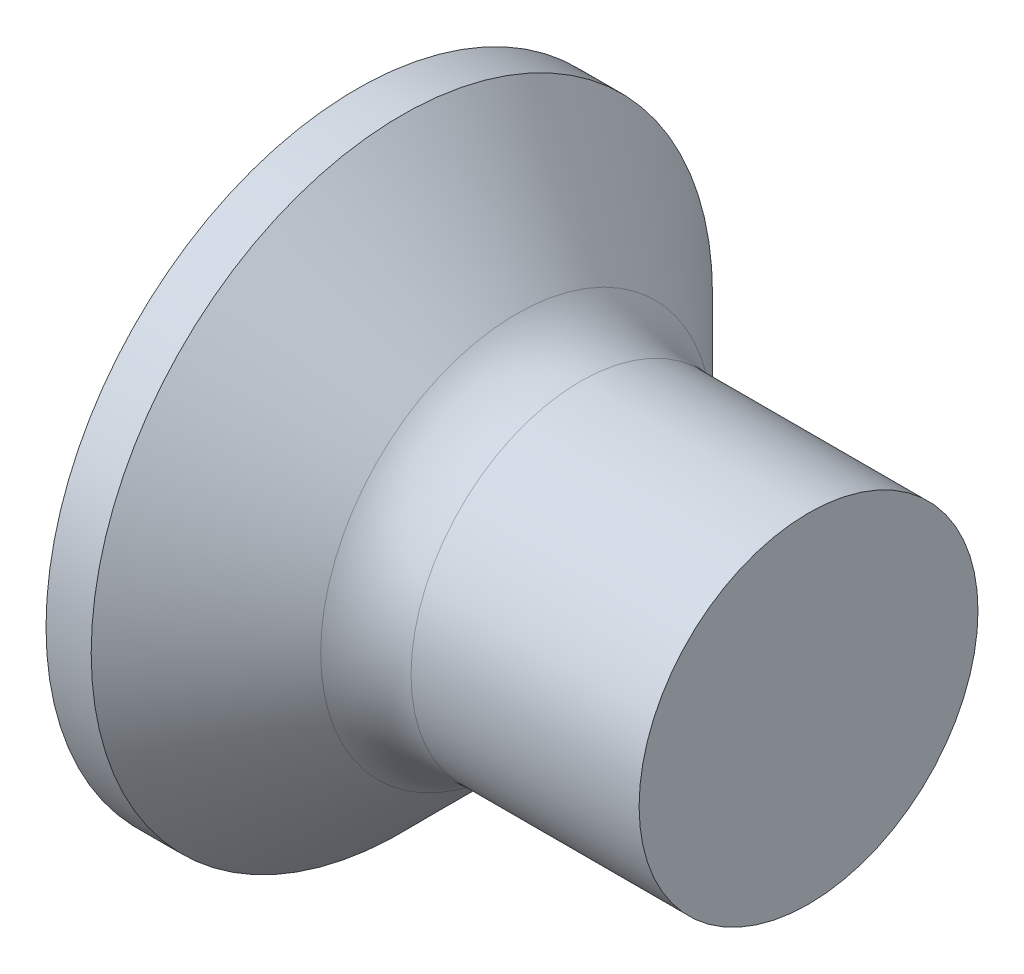
ISO-10303-21;
HEADER;
FILE_DESCRIPTION(('STEP AP214'),'2;1');
FILE_NAME('part.step','',(''),(''),'','','');
FILE_SCHEMA(('AUTOMOTIVE_DESIGN { 1 0 10303 214 1 1 1 1 }'));
ENDSEC;
DATA;
#1=APPLICATION_CONTEXT('core data for automotive mechanical design processes');
#2=APPLICATION_PROTOCOL_DEFINITION('international standard','automotive_design',2000,#1);
#3=PRODUCT_CONTEXT('',#1,'mechanical');
#4=PRODUCT('Part','Part','',(#3));
#5=PRODUCT_RELATED_PRODUCT_CATEGORY('part','',(#4));
#6=PRODUCT_DEFINITION_FORMATION('','',#4);
#7=PRODUCT_DEFINITION_CONTEXT('part definition',#1,'design');
#8=PRODUCT_DEFINITION('design','',#6,#7);
#9=PRODUCT_DEFINITION_SHAPE('','',#8);
#10=(LENGTH_UNIT() NAMED_UNIT(*) SI_UNIT(.MILLI.,.METRE.));
#11=(NAMED_UNIT(*) PLANE_ANGLE_UNIT() SI_UNIT($,.RADIAN.));
#12=(NAMED_UNIT(*) SI_UNIT($,.STERADIAN.) SOLID_ANGLE_UNIT());
#13=UNCERTAINTY_MEASURE_WITH_UNIT(LENGTH_MEASURE(1.E-05),#10,'distance_accuracy_value','');
#14=(GEOMETRIC_REPRESENTATION_CONTEXT(3) GLOBAL_UNCERTAINTY_ASSIGNED_CONTEXT((#13)) GLOBAL_UNIT_ASSIGNED_CONTEXT((#10,
#11,#12)) REPRESENTATION_CONTEXT('',''));
#15=CARTESIAN_POINT('',(0.,0.,0.));
#16=DIRECTION('',(0.,0.,1.));
#17=DIRECTION('',(1.,0.,0.));
#18=AXIS2_PLACEMENT_3D('',#15,#16,#17);
#19=CARTESIAN_POINT('',(2.01,-0.497851135403458,0.37));
#20=DIRECTION('',(0.,0.,-1.));
#21=DIRECTION('',(0.,1.,0.));
#22=AXIS2_PLACEMENT_3D('',#19,#20,#21);
#23=PLANE('',#22);
#24=DIRECTION('',(0.,-1.,0.));
#25=VECTOR('',#24,1.);
#26=CARTESIAN_POINT('',(0.,1.5,0.37));
#27=LINE('',#26,#25);
#28=CARTESIAN_POINT('',(0.,-0.590157547916263,0.37));
#29=VERTEX_POINT('',#28);
#30=CARTESIAN_POINT('',(0.,-1.5,0.37));
#31=VERTEX_POINT('',#30);
#32=EDGE_CURVE('E534',#29,#31,#27,.T.);
#33=ORIENTED_EDGE('',*,*,#32,.F.);
#34=CARTESIAN_POINT('',(-1.01053649691082,-0.672102030072118,0.37));
#35=CARTESIAN_POINT('',(-0.79970605871103,-0.655267098883947,0.37));
#36=CARTESIAN_POINT('',(-0.588886212503304,-0.638297110572311,0.37));
#37=CARTESIAN_POINT('',(-0.16727266252961,-0.603984130519828,0.37));
#38=CARTESIAN_POINT('',(0.0435210406290472,-0.586641131324258,0.37));
#39=CARTESIAN_POINT('',(0.465068838244709,-0.551479911667385,0.37));
#40=CARTESIAN_POINT('',(0.67582293271526,-0.533661691368909,0.37));
#41=CARTESIAN_POINT('',(1.09727362083221,-0.497387538872971,0.37));
#42=CARTESIAN_POINT('',(1.30797021521736,-0.478931615299089,0.37));
#43=CARTESIAN_POINT('',(1.67418894757201,-0.446067164121905,0.37));
#44=CARTESIAN_POINT('',(1.82972932585734,-0.431862501028414,0.37));
#45=CARTESIAN_POINT('',(2.14074770359484,-0.40279770973988,0.37));
#46=CARTESIAN_POINT('',(2.29622570356215,-0.38793758707517,0.37));
#47=CARTESIAN_POINT('',(2.60710169348415,-0.357305117937677,0.37));
#48=CARTESIAN_POINT('',(2.76249967840253,-0.34153271979064,0.37));
#49=CARTESIAN_POINT('',(2.99549070742189,-0.316847908281595,0.37));
#50=CARTESIAN_POINT('',(3.07313791118864,-0.308448465897182,0.37));
#51=CARTESIAN_POINT('',(3.22838341575769,-0.29120225104834,0.37));
#52=CARTESIAN_POINT('',(3.30598171599396,-0.282355473499083,0.37));
#53=CARTESIAN_POINT('',(3.38354828463398,-0.273232461289951,0.37));
#54=B_SPLINE_CURVE_WITH_KNOTS('',3,(#34,#35,#36,#37,#38,#39,#40,#41,#42,#43,#44,#45,#46,#47,#48,
#49,#50,#51,#52,#53),.UNSPECIFIED.,.F.,.F.,(4,2,2,2,2,2,2,2,2,4),(0.,0.634504777554397,
1.26902224766093,1.90353950036111,2.53804817592041,3.00661008438666,3.47516804019383,
3.94375256268972,4.17805198331267,4.41235406779909),.UNSPECIFIED.);
#55=CARTESIAN_POINT('',(2.01,-0.415013252800437,0.37));
#56=VERTEX_POINT('',#55);
#57=EDGE_CURVE('E223',#29,#56,#54,.T.);
#58=ORIENTED_EDGE('',*,*,#57,.T.);
#59=DIRECTION('',(0.,-1.,0.));
#60=VECTOR('',#59,1.);
#61=CARTESIAN_POINT('',(2.01,0.497851135403459,0.37));
#62=LINE('',#61,#60);
#63=CARTESIAN_POINT('',(2.01,-0.497851135403458,0.37));
#64=VERTEX_POINT('',#63);
#65=EDGE_CURVE('E429',#56,#64,#62,.T.);
#66=ORIENTED_EDGE('',*,*,#65,.T.);
#67=DIRECTION('',(0.894934391398442,0.446197753347436,0.));
#68=VECTOR('',#67,1.);
#69=CARTESIAN_POINT('',(0.,-1.5,0.37));
#70=LINE('',#69,#68);
#71=EDGE_CURVE('E543',#31,#64,#70,.T.);
#72=ORIENTED_EDGE('',*,*,#71,.F.);
#73=EDGE_LOOP('',(#33,#58,#66,#72));
#74=FACE_BOUND('',#73,.T.);
#75=ADVANCED_FACE('F43',(#74),#23,.T.);
#76=CARTESIAN_POINT('',(2.01,0.497851135403459,0.37));
#77=VERTEX_POINT('',#76);
#78=CARTESIAN_POINT('',(2.01,0.415013252800437,0.37));
#79=VERTEX_POINT('',#78);
#80=EDGE_CURVE('E425',#77,#79,#62,.T.);
#81=ORIENTED_EDGE('',*,*,#80,.T.);
#82=CARTESIAN_POINT('',(-1.01053649699026,0.672102030078459,0.37));
#83=CARTESIAN_POINT('',(-0.799706058781648,0.65526709888962,0.37));
#84=CARTESIAN_POINT('',(-0.588886212565099,0.638297110577309,0.37));
#85=CARTESIAN_POINT('',(-0.167272662573758,0.603984130523453,0.37));
#86=CARTESIAN_POINT('',(0.043521040593722,0.586641131327185,0.37));
#87=CARTESIAN_POINT('',(0.465068838236453,0.551479911668094,0.37));
#88=CARTESIAN_POINT('',(0.675822932725248,0.533661691368078,0.37));
#89=CARTESIAN_POINT('',(1.09727362087867,0.497387538868943,0.37));
#90=CARTESIAN_POINT('',(1.30797021528206,0.478931615293404,0.37));
#91=CARTESIAN_POINT('',(1.67418894765493,0.446067164114376,0.37));
#92=CARTESIAN_POINT('',(1.82972932594025,0.431862501020785,0.37));
#93=CARTESIAN_POINT('',(2.14074770367772,0.402797709732016,0.37));
#94=CARTESIAN_POINT('',(2.29622570364503,0.38793758706717,0.37));
#95=CARTESIAN_POINT('',(2.60710169356699,0.357305117929346,0.37));
#96=CARTESIAN_POINT('',(2.76249967848536,0.341532719782116,0.37));
#97=CARTESIAN_POINT('',(2.99549070750469,0.316847908272698,0.37));
#98=CARTESIAN_POINT('',(3.07313791127142,0.308448465888148,0.37));
#99=CARTESIAN_POINT('',(3.22838341584044,0.291202251038989,0.37));
#100=CARTESIAN_POINT('',(3.30598171607669,0.282355473489554,0.37));
#101=CARTESIAN_POINT('',(3.38354828471668,0.273232461280216,0.37));
#102=B_SPLINE_CURVE_WITH_KNOTS('',3,(#82,#83,#84,#85,#86,#87,#88,#89,#90,#91,#92,#93,#94,#95,
#96,#97,#98,#99,#100,#101),.UNSPECIFIED.,.F.,.F.,(4,2,2,2,2,2,2,2,2,4),(0.,0.634504777580945,
1.26902224771403,1.90353950046914,2.53804817608336,3.00661008454961,3.47516804035678,
3.94375256285269,4.17805198347564,4.41235406796206),.UNSPECIFIED.);
#103=CARTESIAN_POINT('',(0.,0.590157547916263,0.37));
#104=VERTEX_POINT('',#103);
#105=EDGE_CURVE('E216',#79,#104,#102,.F.);
#106=ORIENTED_EDGE('',*,*,#105,.T.);
#107=CARTESIAN_POINT('',(0.,1.5,0.37));
#108=VERTEX_POINT('',#107);
#109=EDGE_CURVE('E536',#108,#104,#27,.T.);
#110=ORIENTED_EDGE('',*,*,#109,.F.);
#111=DIRECTION('',(0.894934391398442,-0.446197753347436,0.));
#112=VECTOR('',#111,1.);
#113=CARTESIAN_POINT('',(0.,1.5,0.37));
#114=LINE('',#113,#112);
#115=EDGE_CURVE('E67',#108,#77,#114,.T.);
#116=ORIENTED_EDGE('',*,*,#115,.T.);
#117=EDGE_LOOP('',(#81,#106,#110,#116));
#118=FACE_BOUND('',#117,.T.);
#119=ADVANCED_FACE('F198',(#118),#23,.T.);
#120=CARTESIAN_POINT('',(2.01,0.497851135403458,-0.37));
#121=DIRECTION('',(0.,0.,1.));
#122=DIRECTION('',(1.,0.,0.));
#123=AXIS2_PLACEMENT_3D('',#120,#121,#122);
#124=PLANE('',#123);
#125=DIRECTION('',(0.,1.,0.));
#126=VECTOR('',#125,1.);
#127=CARTESIAN_POINT('',(2.01,-0.497851135403458,-0.37));
#128=LINE('',#127,#126);
#129=CARTESIAN_POINT('',(2.01,-0.497851135403458,-0.37));
#130=VERTEX_POINT('',#129);
#131=CARTESIAN_POINT('',(2.01,-0.415013252800437,-0.37));
#132=VERTEX_POINT('',#131);
#133=EDGE_CURVE('E440',#130,#132,#128,.T.);
#134=ORIENTED_EDGE('',*,*,#133,.T.);
#135=CARTESIAN_POINT('',(-1.01053649691082,-0.672102030072118,-0.37));
#136=CARTESIAN_POINT('',(-0.79970605871103,-0.655267098883947,-0.37));
#137=CARTESIAN_POINT('',(-0.588886212503305,-0.638297110572311,-0.37));
#138=CARTESIAN_POINT('',(-0.16727266252961,-0.603984130519828,-0.37));
#139=CARTESIAN_POINT('',(0.0435210406290472,-0.586641131324259,-0.37));
#140=CARTESIAN_POINT('',(0.465068838244709,-0.551479911667385,-0.37));
#141=CARTESIAN_POINT('',(0.67582293271526,-0.533661691368909,-0.37));
#142=CARTESIAN_POINT('',(1.09727362083221,-0.497387538872971,-0.37));
#143=CARTESIAN_POINT('',(1.30797021521736,-0.47893161529909,-0.37));
#144=CARTESIAN_POINT('',(1.67418894757201,-0.446067164121906,-0.37));
#145=CARTESIAN_POINT('',(1.82972932585734,-0.431862501028414,-0.37));
#146=CARTESIAN_POINT('',(2.14074770359484,-0.40279770973988,-0.37));
#147=CARTESIAN_POINT('',(2.29622570356215,-0.38793758707517,-0.37));
#148=CARTESIAN_POINT('',(2.60710169348415,-0.357305117937677,-0.37));
#149=CARTESIAN_POINT('',(2.76249967840254,-0.34153271979064,-0.37));
#150=CARTESIAN_POINT('',(2.99549070742189,-0.316847908281595,-0.37));
#151=CARTESIAN_POINT('',(3.07313791118864,-0.308448465897182,-0.37));
#152=CARTESIAN_POINT('',(3.22838341575769,-0.29120225104834,-0.37));
#153=CARTESIAN_POINT('',(3.30598171599396,-0.282355473499083,-0.37));
#154=CARTESIAN_POINT('',(3.38354828463398,-0.273232461289951,-0.37));
#155=B_SPLINE_CURVE_WITH_KNOTS('',3,(#135,#136,#137,#138,#139,#140,#141,#142,#143,#144,#145,
#146,#147,#148,#149,#150,#151,#152,#153,#154),.UNSPECIFIED.,.F.,.F.,(4,2,2,2,2,2,2,2,2,4),(0.,
0.634504777554397,1.26902224766093,1.90353950036111,2.53804817592041,3.00661008438666,
3.47516804019383,3.94375256268973,4.17805198331268,4.41235406779909),.UNSPECIFIED.);
#156=CARTESIAN_POINT('',(0.,-0.590157547916263,-0.37));
#157=VERTEX_POINT('',#156);
#158=EDGE_CURVE('E280',#132,#157,#155,.F.);
#159=ORIENTED_EDGE('',*,*,#158,.T.);
#160=DIRECTION('',(0.,1.,0.));
#161=VECTOR('',#160,1.);
#162=CARTESIAN_POINT('',(0.,-1.5,-0.37));
#163=LINE('',#162,#161);
#164=CARTESIAN_POINT('',(0.,-1.5,-0.37));
#165=VERTEX_POINT('',#164);
#166=EDGE_CURVE('E535',#165,#157,#163,.T.);
#167=ORIENTED_EDGE('',*,*,#166,.F.);
#168=DIRECTION('',(0.894934391398442,0.446197753347436,0.));
#169=VECTOR('',#168,1.);
#170=CARTESIAN_POINT('',(0.,-1.5,-0.37));
#171=LINE('',#170,#169);
#172=EDGE_CURVE('E546',#165,#130,#171,.T.);
#173=ORIENTED_EDGE('',*,*,#172,.T.);
#174=EDGE_LOOP('',(#134,#159,#167,#173));
#175=FACE_BOUND('',#174,.T.);
#176=ADVANCED_FACE('F204',(#175),#124,.T.);
#177=CARTESIAN_POINT('',(0.,0.590157547916263,-0.37));
#178=VERTEX_POINT('',#177);
#179=CARTESIAN_POINT('',(0.,1.5,-0.37));
#180=VERTEX_POINT('',#179);
#181=EDGE_CURVE('E542',#178,#180,#163,.T.);
#182=ORIENTED_EDGE('',*,*,#181,.F.);
#183=CARTESIAN_POINT('',(-1.01053649691082,0.672102030072118,-0.37));
#184=CARTESIAN_POINT('',(-0.79970605871103,0.655267098883947,-0.37));
#185=CARTESIAN_POINT('',(-0.588886212503304,0.638297110572311,-0.37));
#186=CARTESIAN_POINT('',(-0.16727266252961,0.603984130519828,-0.37));
#187=CARTESIAN_POINT('',(0.0435210406290473,0.586641131324259,-0.37));
#188=CARTESIAN_POINT('',(0.465068838244709,0.551479911667385,-0.37));
#189=CARTESIAN_POINT('',(0.67582293271526,0.533661691368909,-0.37));
#190=CARTESIAN_POINT('',(1.09727362083221,0.497387538872971,-0.37));
#191=CARTESIAN_POINT('',(1.30797021521736,0.478931615299089,-0.37));
#192=CARTESIAN_POINT('',(1.67418894757201,0.446067164121906,-0.37));
#193=CARTESIAN_POINT('',(1.82972932585734,0.431862501028415,-0.37));
#194=CARTESIAN_POINT('',(2.14074770359484,0.40279770973988,-0.37));
#195=CARTESIAN_POINT('',(2.29622570356215,0.38793758707517,-0.37));
#196=CARTESIAN_POINT('',(2.60710169348415,0.357305117937677,-0.37));
#197=CARTESIAN_POINT('',(2.76249967840253,0.34153271979064,-0.37));
#198=CARTESIAN_POINT('',(2.99549070742189,0.316847908281595,-0.37));
#199=CARTESIAN_POINT('',(3.07313791118864,0.308448465897183,-0.37));
#200=CARTESIAN_POINT('',(3.22838341575769,0.29120225104834,-0.37));
#201=CARTESIAN_POINT('',(3.30598171599396,0.282355473499083,-0.37));
#202=CARTESIAN_POINT('',(3.38354828463398,0.273232461289951,-0.37));
#203=B_SPLINE_CURVE_WITH_KNOTS('',3,(#183,#184,#185,#186,#187,#188,#189,#190,#191,#192,#193,
#194,#195,#196,#197,#198,#199,#200,#201,#202),.UNSPECIFIED.,.F.,.F.,(4,2,2,2,2,2,2,2,2,4),(0.,
0.634504777554397,1.26902224766093,1.90353950036111,2.53804817592041,3.00661008438666,
3.47516804019383,3.94375256268972,4.17805198331267,4.41235406779909),.UNSPECIFIED.);
#204=CARTESIAN_POINT('',(2.01,0.415013252800437,-0.37));
#205=VERTEX_POINT('',#204);
#206=EDGE_CURVE('E274',#178,#205,#203,.T.);
#207=ORIENTED_EDGE('',*,*,#206,.T.);
#208=CARTESIAN_POINT('',(2.01,0.497851135403459,-0.37));
#209=VERTEX_POINT('',#208);
#210=EDGE_CURVE('E442',#205,#209,#128,.T.);
#211=ORIENTED_EDGE('',*,*,#210,.T.);
#212=DIRECTION('',(0.894934391398442,-0.446197753347436,0.));
#213=VECTOR('',#212,1.);
#214=CARTESIAN_POINT('',(0.,1.5,-0.37));
#215=LINE('',#214,#213);
#216=EDGE_CURVE('E439',#180,#209,#215,.T.);
#217=ORIENTED_EDGE('',*,*,#216,.F.);
#218=EDGE_LOOP('',(#182,#207,#211,#217));
#219=FACE_BOUND('',#218,.T.);
#220=ADVANCED_FACE('F554',(#219),#124,.T.);
#221=CARTESIAN_POINT('',(2.01,0.497851135403459,-0.37));
#222=DIRECTION('',(1.,0.,0.));
#223=DIRECTION('',(0.,0.,-1.));
#224=AXIS2_PLACEMENT_3D('',#221,#222,#223);
#225=PLANE('',#224);
#226=CARTESIAN_POINT('',(2.01,0.,0.));
#227=DIRECTION('',(-1.,0.,0.));
#228=DIRECTION('',(0.,0.,1.));
#229=AXIS2_PLACEMENT_3D('',#226,#227,#228);
#230=CIRCLE('',#229,0.555999999999999);
#231=CARTESIAN_POINT('',(2.01,-0.24754847399547,-0.497851135403459));
#232=VERTEX_POINT('',#231);
#233=CARTESIAN_POINT('',(2.01,-0.369999999999999,-0.415013252800438));
#234=VERTEX_POINT('',#233);
#235=EDGE_CURVE('E394',#232,#234,#230,.T.);
#236=ORIENTED_EDGE('',*,*,#235,.F.);
#237=DIRECTION('',(0.,1.,0.));
#238=VECTOR('',#237,1.);
#239=CARTESIAN_POINT('',(2.01,-0.369999999999998,-0.49785113540346));
#240=LINE('',#239,#238);
#241=CARTESIAN_POINT('',(2.01,-0.369999999999998,-0.49785113540346));
#242=VERTEX_POINT('',#241);
#243=EDGE_CURVE('E516',#242,#232,#240,.T.);
#244=ORIENTED_EDGE('',*,*,#243,.F.);
#245=DIRECTION('',(0.,0.,-1.));
#246=VECTOR('',#245,1.);
#247=CARTESIAN_POINT('',(2.01,-0.370000000000002,0.497851135403457));
#248=LINE('',#247,#246);
#249=EDGE_CURVE('E520',#234,#242,#248,.T.);
#250=ORIENTED_EDGE('',*,*,#249,.F.);
#251=EDGE_LOOP('',(#236,#244,#250));
#252=FACE_BOUND('',#251,.T.);
#253=ADVANCED_FACE('F568',(#252),#225,.F.);
#254=CARTESIAN_POINT('',(2.01,-0.497851135403458,-0.247548473995472));
#255=VERTEX_POINT('',#254);
#256=EDGE_CURVE('E386',#132,#255,#230,.T.);
#257=ORIENTED_EDGE('',*,*,#256,.F.);
#258=ORIENTED_EDGE('',*,*,#133,.F.);
#259=DIRECTION('',(0.,0.,-1.));
#260=VECTOR('',#259,1.);
#261=CARTESIAN_POINT('',(2.01,-0.497851135403458,0.37));
#262=LINE('',#261,#260);
#263=EDGE_CURVE('E428',#255,#130,#262,.T.);
#264=ORIENTED_EDGE('',*,*,#263,.F.);
#265=EDGE_LOOP('',(#257,#258,#264));
#266=FACE_BOUND('',#265,.T.);
#267=ADVANCED_FACE('F574',(#266),#225,.F.);
#268=CARTESIAN_POINT('',(2.01,-0.497851135403458,0.247548473995472));
#269=VERTEX_POINT('',#268);
#270=EDGE_CURVE('E379',#269,#56,#230,.T.);
#271=ORIENTED_EDGE('',*,*,#270,.F.);
#272=EDGE_CURVE('E432',#64,#269,#262,.T.);
#273=ORIENTED_EDGE('',*,*,#272,.F.);
#274=ORIENTED_EDGE('',*,*,#65,.F.);
#275=EDGE_LOOP('',(#271,#273,#274));
#276=FACE_BOUND('',#275,.T.);
#277=ADVANCED_FACE('F580',(#276),#225,.F.);
#278=CARTESIAN_POINT('',(2.01,-0.370000000000001,0.415013252800436));
#279=VERTEX_POINT('',#278);
#280=CARTESIAN_POINT('',(2.01,-0.247548473995473,0.497851135403458));
#281=VERTEX_POINT('',#280);
#282=EDGE_CURVE('E59',#279,#281,#230,.T.);
#283=ORIENTED_EDGE('',*,*,#282,.F.);
#284=CARTESIAN_POINT('',(2.01,-0.370000000000002,0.497851135403457));
#285=VERTEX_POINT('',#284);
#286=EDGE_CURVE('E522',#285,#279,#248,.T.);
#287=ORIENTED_EDGE('',*,*,#286,.F.);
#288=DIRECTION('',(0.,-1.,0.));
#289=VECTOR('',#288,1.);
#290=CARTESIAN_POINT('',(2.01,0.369999999999998,0.49785113540346));
#291=LINE('',#290,#289);
#292=EDGE_CURVE('E521',#281,#285,#291,.T.);
#293=ORIENTED_EDGE('',*,*,#292,.F.);
#294=EDGE_LOOP('',(#283,#287,#293));
#295=FACE_BOUND('',#294,.T.);
#296=ADVANCED_FACE('F607',(#295),#225,.F.);
#297=CARTESIAN_POINT('',(2.01,0.24754847399547,0.497851135403459));
#298=VERTEX_POINT('',#297);
#299=CARTESIAN_POINT('',(2.01,0.369999999999999,0.415013252800438));
#300=VERTEX_POINT('',#299);
#301=EDGE_CURVE('E361',#298,#300,#230,.T.);
#302=ORIENTED_EDGE('',*,*,#301,.F.);
#303=CARTESIAN_POINT('',(2.01,0.369999999999998,0.49785113540346));
#304=VERTEX_POINT('',#303);
#305=EDGE_CURVE('E517',#304,#298,#291,.T.);
#306=ORIENTED_EDGE('',*,*,#305,.F.);
#307=DIRECTION('',(0.,0.,1.));
#308=VECTOR('',#307,1.);
#309=CARTESIAN_POINT('',(2.01,0.370000000000002,-0.497851135403457));
#310=LINE('',#309,#308);
#311=EDGE_CURVE('E231',#300,#304,#310,.T.);
#312=ORIENTED_EDGE('',*,*,#311,.F.);
#313=EDGE_LOOP('',(#302,#306,#312));
#314=FACE_BOUND('',#313,.T.);
#315=ADVANCED_FACE('F564',(#314),#225,.F.);
#316=CARTESIAN_POINT('',(2.01,0.497851135403459,0.247548473995472));
#317=VERTEX_POINT('',#316);
#318=EDGE_CURVE('E372',#79,#317,#230,.T.);
#319=ORIENTED_EDGE('',*,*,#318,.F.);
#320=ORIENTED_EDGE('',*,*,#80,.F.);
#321=DIRECTION('',(0.,0.,1.));
#322=VECTOR('',#321,1.);
#323=CARTESIAN_POINT('',(2.01,0.497851135403459,-0.37));
#324=LINE('',#323,#322);
#325=EDGE_CURVE('E426',#317,#77,#324,.T.);
#326=ORIENTED_EDGE('',*,*,#325,.F.);
#327=EDGE_LOOP('',(#319,#320,#326));
#328=FACE_BOUND('',#327,.T.);
#329=ADVANCED_FACE('F424',(#328),#225,.F.);
#330=CARTESIAN_POINT('',(2.01,0.497851135403459,-0.247548473995472));
#331=VERTEX_POINT('',#330);
#332=EDGE_CURVE('E412',#331,#205,#230,.T.);
#333=ORIENTED_EDGE('',*,*,#332,.F.);
#334=EDGE_CURVE('E434',#209,#331,#324,.T.);
#335=ORIENTED_EDGE('',*,*,#334,.F.);
#336=ORIENTED_EDGE('',*,*,#210,.F.);
#337=EDGE_LOOP('',(#333,#335,#336));
#338=FACE_BOUND('',#337,.T.);
#339=ADVANCED_FACE('F556',(#338),#225,.F.);
#340=CARTESIAN_POINT('',(2.01,-0.497851135403458,-0.37));
#341=DIRECTION('',(-0.446197753347436,0.894934391398443,0.));
#342=DIRECTION('',(-0.894934391398442,-0.446197753347436,0.));
#343=AXIS2_PLACEMENT_3D('',#340,#341,#342);
#344=PLANE('',#343);
#345=ORIENTED_EDGE('',*,*,#272,.T.);
#346=CARTESIAN_POINT('',(2.86902919914418,-0.0695550475538963,0.));
#347=DIRECTION('',(-0.446197753347436,0.894934391398443,0.));
#348=DIRECTION('',(-0.894934391398443,-0.446197753347436,0.));
#349=AXIS2_PLACEMENT_3D('',#346,#347,#348);
#350=ELLIPSE('',#349,1.11145971268776,0.491029001453358);
#351=EDGE_CURVE('E296',#269,#255,#350,.F.);
#352=ORIENTED_EDGE('',*,*,#351,.T.);
#353=ORIENTED_EDGE('',*,*,#263,.T.);
#354=ORIENTED_EDGE('',*,*,#172,.F.);
#355=DIRECTION('',(0.,0.,-1.));
#356=VECTOR('',#355,1.);
#357=CARTESIAN_POINT('',(0.,-1.5,0.37));
#358=LINE('',#357,#356);
#359=EDGE_CURVE('E448',#31,#165,#358,.T.);
#360=ORIENTED_EDGE('',*,*,#359,.F.);
#361=ORIENTED_EDGE('',*,*,#71,.T.);
#362=EDGE_LOOP('',(#345,#352,#353,#354,#360,#361));
#363=FACE_BOUND('',#362,.T.);
#364=ADVANCED_FACE('F210',(#363),#344,.T.);
#365=CARTESIAN_POINT('',(2.01,0.497851135403459,0.37));
#366=DIRECTION('',(-0.446197753347436,-0.894934391398443,0.));
#367=DIRECTION('',(0.894934391398442,-0.446197753347436,0.));
#368=AXIS2_PLACEMENT_3D('',#365,#366,#367);
#369=PLANE('',#368);
#370=ORIENTED_EDGE('',*,*,#334,.T.);
#371=CARTESIAN_POINT('',(2.86902919914418,0.0695550475538964,0.));
#372=DIRECTION('',(-0.446197753347436,-0.894934391398443,0.));
#373=DIRECTION('',(-0.894934391398443,0.446197753347436,0.));
#374=AXIS2_PLACEMENT_3D('',#371,#372,#373);
#375=ELLIPSE('',#374,1.11145971268776,0.491029001453358);
#376=EDGE_CURVE('E304',#331,#317,#375,.F.);
#377=ORIENTED_EDGE('',*,*,#376,.T.);
#378=ORIENTED_EDGE('',*,*,#325,.T.);
#379=ORIENTED_EDGE('',*,*,#115,.F.);
#380=DIRECTION('',(0.,0.,1.));
#381=VECTOR('',#380,1.);
#382=CARTESIAN_POINT('',(0.,1.5,-0.37));
#383=LINE('',#382,#381);
#384=EDGE_CURVE('E530',#180,#108,#383,.T.);
#385=ORIENTED_EDGE('',*,*,#384,.F.);
#386=ORIENTED_EDGE('',*,*,#216,.T.);
#387=EDGE_LOOP('',(#370,#377,#378,#379,#385,#386));
#388=FACE_BOUND('',#387,.T.);
#389=ADVANCED_FACE('F552',(#388),#369,.T.);
#390=CARTESIAN_POINT('',(2.01,0.369999999999998,0.497851135403459));
#391=DIRECTION('',(0.,-1.,0.));
#392=DIRECTION('',(1.,0.,0.));
#393=AXIS2_PLACEMENT_3D('',#390,#391,#392);
#394=PLANE('',#393);
#395=CARTESIAN_POINT('',(2.01,0.370000000000002,-0.497851135403457));
#396=VERTEX_POINT('',#395);
#397=CARTESIAN_POINT('',(2.01,0.370000000000001,-0.415013252800436));
#398=VERTEX_POINT('',#397);
#399=EDGE_CURVE('E527',#396,#398,#310,.T.);
#400=ORIENTED_EDGE('',*,*,#399,.T.);
#401=CARTESIAN_POINT('',(-1.01053649699026,0.370000000000002,-0.672102030078458));
#402=CARTESIAN_POINT('',(-0.799706058781648,0.370000000000002,-0.655267098889619));
#403=CARTESIAN_POINT('',(-0.588886212565099,0.370000000000002,-0.638297110577308));
#404=CARTESIAN_POINT('',(-0.167272662573758,0.370000000000002,-0.603984130523452));
#405=CARTESIAN_POINT('',(0.0435210405937218,0.370000000000002,-0.586641131327184));
#406=CARTESIAN_POINT('',(0.465068838236452,0.370000000000002,-0.551479911668093));
#407=CARTESIAN_POINT('',(0.675822932725247,0.370000000000002,-0.533661691368077));
#408=CARTESIAN_POINT('',(1.09727362087867,0.370000000000002,-0.497387538868942));
#409=CARTESIAN_POINT('',(1.30797021528206,0.370000000000002,-0.478931615293403));
#410=CARTESIAN_POINT('',(1.67418894765493,0.370000000000001,-0.446067164114375));
#411=CARTESIAN_POINT('',(1.82972932594025,0.370000000000001,-0.431862501020784));
#412=CARTESIAN_POINT('',(2.14074770367772,0.370000000000001,-0.402797709732014));
#413=CARTESIAN_POINT('',(2.29622570364503,0.370000000000001,-0.387937587067169));
#414=CARTESIAN_POINT('',(2.60710169356699,0.370000000000001,-0.357305117929345));
#415=CARTESIAN_POINT('',(2.76249967848536,0.370000000000001,-0.341532719782114));
#416=CARTESIAN_POINT('',(2.99549070750468,0.370000000000001,-0.316847908272697));
#417=CARTESIAN_POINT('',(3.07313791127142,0.370000000000001,-0.308448465888147));
#418=CARTESIAN_POINT('',(3.22838341584044,0.370000000000001,-0.291202251038988));
#419=CARTESIAN_POINT('',(3.30598171607669,0.370000000000001,-0.282355473489552));
#420=CARTESIAN_POINT('',(3.38354828471668,0.370000000000001,-0.273232461280215));
#421=B_SPLINE_CURVE_WITH_KNOTS('',3,(#401,#402,#403,#404,#405,#406,#407,#408,#409,#410,#411,
#412,#413,#414,#415,#416,#417,#418,#419,#420),.UNSPECIFIED.,.F.,.F.,(4,2,2,2,2,2,2,2,2,4),(0.,
0.634504777580945,1.26902224771403,1.90353950046914,2.53804817608336,3.00661008454961,
3.47516804035678,3.94375256285268,4.17805198347564,4.41235406796206),.UNSPECIFIED.);
#422=CARTESIAN_POINT('',(0.,0.370000000000002,-0.590157547916262));
#423=VERTEX_POINT('',#422);
#424=EDGE_CURVE('E266',#398,#423,#421,.F.);
#425=ORIENTED_EDGE('',*,*,#424,.T.);
#426=DIRECTION('',(0.,0.,1.));
#427=VECTOR('',#426,1.);
#428=CARTESIAN_POINT('',(0.,0.370000000000005,-1.5));
#429=LINE('',#428,#427);
#430=CARTESIAN_POINT('',(0.,0.370000000000005,-1.5));
#431=VERTEX_POINT('',#430);
#432=EDGE_CURVE('E498',#431,#423,#429,.T.);
#433=ORIENTED_EDGE('',*,*,#432,.F.);
#434=DIRECTION('',(0.894934391398442,0.,0.446197753347436));
#435=VECTOR('',#434,1.);
#436=CARTESIAN_POINT('',(0.,0.370000000000005,-1.5));
#437=LINE('',#436,#435);
#438=EDGE_CURVE('E505',#431,#396,#437,.T.);
#439=ORIENTED_EDGE('',*,*,#438,.T.);
#440=EDGE_LOOP('',(#400,#425,#433,#439));
#441=FACE_BOUND('',#440,.T.);
#442=ADVANCED_FACE('F611',(#441),#394,.T.);
#443=CARTESIAN_POINT('',(2.01,-0.369999999999998,-0.497851135403459));
#444=DIRECTION('',(0.,1.,0.));
#445=DIRECTION('',(0.,0.,1.));
#446=AXIS2_PLACEMENT_3D('',#443,#444,#445);
#447=PLANE('',#446);
#448=DIRECTION('',(0.,0.,-1.));
#449=VECTOR('',#448,1.);
#450=CARTESIAN_POINT('',(0.,-0.370000000000005,1.5));
#451=LINE('',#450,#449);
#452=CARTESIAN_POINT('',(0.,-0.369999999999998,-0.590157547916264));
#453=VERTEX_POINT('',#452);
#454=CARTESIAN_POINT('',(0.,-0.369999999999995,-1.5));
#455=VERTEX_POINT('',#454);
#456=EDGE_CURVE('E493',#453,#455,#451,.T.);
#457=ORIENTED_EDGE('',*,*,#456,.F.);
#458=CARTESIAN_POINT('',(-1.01053649699026,-0.369999999999998,-0.67210203007846));
#459=CARTESIAN_POINT('',(-0.799706058781648,-0.369999999999998,-0.655267098889622));
#460=CARTESIAN_POINT('',(-0.588886212565099,-0.369999999999998,-0.638297110577311));
#461=CARTESIAN_POINT('',(-0.167272662573759,-0.369999999999998,-0.603984130523454));
#462=CARTESIAN_POINT('',(0.0435210405937218,-0.369999999999998,-0.586641131327186));
#463=CARTESIAN_POINT('',(0.465068838236453,-0.369999999999998,-0.551479911668095));
#464=CARTESIAN_POINT('',(0.675822932725248,-0.369999999999998,-0.53366169136808));
#465=CARTESIAN_POINT('',(1.09727362087867,-0.369999999999998,-0.497387538868944));
#466=CARTESIAN_POINT('',(1.30797021528206,-0.369999999999998,-0.478931615293405));
#467=CARTESIAN_POINT('',(1.67418894765493,-0.369999999999999,-0.446067164114377));
#468=CARTESIAN_POINT('',(1.82972932594025,-0.369999999999999,-0.431862501020787));
#469=CARTESIAN_POINT('',(2.14074770367772,-0.369999999999999,-0.402797709732017));
#470=CARTESIAN_POINT('',(2.29622570364503,-0.369999999999999,-0.387937587067172));
#471=CARTESIAN_POINT('',(2.60710169356699,-0.369999999999999,-0.357305117929348));
#472=CARTESIAN_POINT('',(2.76249967848536,-0.369999999999999,-0.341532719782117));
#473=CARTESIAN_POINT('',(2.99549070750468,-0.369999999999999,-0.3168479082727));
#474=CARTESIAN_POINT('',(3.07313791127142,-0.369999999999999,-0.30844846588815));
#475=CARTESIAN_POINT('',(3.22838341584044,-0.369999999999999,-0.291202251038991));
#476=CARTESIAN_POINT('',(3.30598171607669,-0.369999999999999,-0.282355473489555));
#477=CARTESIAN_POINT('',(3.38354828471668,-0.369999999999999,-0.273232461280217));
#478=B_SPLINE_CURVE_WITH_KNOTS('',3,(#458,#459,#460,#461,#462,#463,#464,#465,#466,#467,#468,
#469,#470,#471,#472,#473,#474,#475,#476,#477),.UNSPECIFIED.,.F.,.F.,(4,2,2,2,2,2,2,2,2,4),(0.,
0.634504777580944,1.26902224771403,1.90353950046914,2.53804817608336,3.00661008454961,
3.47516804035678,3.94375256285268,4.17805198347564,4.41235406796206),.UNSPECIFIED.);
#479=EDGE_CURVE('E259',#453,#234,#478,.T.);
#480=ORIENTED_EDGE('',*,*,#479,.T.);
#481=ORIENTED_EDGE('',*,*,#249,.T.);
#482=DIRECTION('',(0.894934391398442,0.,0.446197753347436));
#483=VECTOR('',#482,1.);
#484=CARTESIAN_POINT('',(0.,-0.369999999999995,-1.5));
#485=LINE('',#484,#483);
#486=EDGE_CURVE('E502',#455,#242,#485,.T.);
#487=ORIENTED_EDGE('',*,*,#486,.F.);
#488=EDGE_LOOP('',(#457,#480,#481,#487));
#489=FACE_BOUND('',#488,.T.);
#490=ADVANCED_FACE('F585',(#489),#447,.T.);
#491=CARTESIAN_POINT('',(2.01,0.370000000000002,-0.497851135403457));
#492=DIRECTION('',(-0.446197753347436,0.,0.894934391398443));
#493=DIRECTION('',(-0.894934391398442,0.,-0.446197753347436));
#494=AXIS2_PLACEMENT_3D('',#491,#492,#493);
#495=PLANE('',#494);
#496=ORIENTED_EDGE('',*,*,#243,.T.);
#497=CARTESIAN_POINT('',(2.86902919914418,0.,-0.0695550475538964));
#498=DIRECTION('',(-0.446197753347436,0.,0.894934391398443));
#499=DIRECTION('',(-0.894934391398443,0.,-0.446197753347436));
#500=AXIS2_PLACEMENT_3D('',#497,#498,#499);
#501=ELLIPSE('',#500,1.11145971268776,0.491029001453358);
#502=CARTESIAN_POINT('',(2.01,0.247548473995474,-0.497851135403457));
#503=VERTEX_POINT('',#502);
#504=EDGE_CURVE('E326',#232,#503,#501,.F.);
#505=ORIENTED_EDGE('',*,*,#504,.T.);
#506=EDGE_CURVE('E525',#503,#396,#240,.T.);
#507=ORIENTED_EDGE('',*,*,#506,.T.);
#508=ORIENTED_EDGE('',*,*,#438,.F.);
#509=DIRECTION('',(0.,1.,0.));
#510=VECTOR('',#509,1.);
#511=CARTESIAN_POINT('',(0.,-0.369999999999995,-1.5));
#512=LINE('',#511,#510);
#513=EDGE_CURVE('E492',#455,#431,#512,.T.);
#514=ORIENTED_EDGE('',*,*,#513,.F.);
#515=ORIENTED_EDGE('',*,*,#486,.T.);
#516=EDGE_LOOP('',(#496,#505,#507,#508,#514,#515));
#517=FACE_BOUND('',#516,.T.);
#518=ADVANCED_FACE('F236',(#517),#495,.T.);
#519=ORIENTED_EDGE('',*,*,#286,.T.);
#520=CARTESIAN_POINT('',(-1.01053649699026,-0.370000000000002,0.672102030078458));
#521=CARTESIAN_POINT('',(-0.799706058781648,-0.370000000000002,0.655267098889619));
#522=CARTESIAN_POINT('',(-0.588886212565099,-0.370000000000002,0.638297110577308));
#523=CARTESIAN_POINT('',(-0.167272662573758,-0.370000000000002,0.603984130523451));
#524=CARTESIAN_POINT('',(0.0435210405937218,-0.370000000000002,0.586641131327183));
#525=CARTESIAN_POINT('',(0.465068838236452,-0.370000000000002,0.551479911668093));
#526=CARTESIAN_POINT('',(0.675822932725247,-0.370000000000002,0.533661691368077));
#527=CARTESIAN_POINT('',(1.09727362087867,-0.370000000000002,0.497387538868942));
#528=CARTESIAN_POINT('',(1.30797021528206,-0.370000000000002,0.478931615293403));
#529=CARTESIAN_POINT('',(1.67418894765493,-0.370000000000002,0.446067164114375));
#530=CARTESIAN_POINT('',(1.82972932594025,-0.370000000000001,0.431862501020784));
#531=CARTESIAN_POINT('',(2.14074770367772,-0.370000000000001,0.402797709732014));
#532=CARTESIAN_POINT('',(2.29622570364503,-0.370000000000001,0.387937587067169));
#533=CARTESIAN_POINT('',(2.60710169356699,-0.370000000000001,0.357305117929345));
#534=CARTESIAN_POINT('',(2.76249967848536,-0.370000000000001,0.341532719782114));
#535=CARTESIAN_POINT('',(2.99549070750468,-0.370000000000001,0.316847908272697));
#536=CARTESIAN_POINT('',(3.07313791127142,-0.370000000000001,0.308448465888147));
#537=CARTESIAN_POINT('',(3.22838341584044,-0.370000000000001,0.291202251038988));
#538=CARTESIAN_POINT('',(3.30598171607669,-0.370000000000001,0.282355473489553));
#539=CARTESIAN_POINT('',(3.38354828471668,-0.370000000000001,0.273232461280215));
#540=B_SPLINE_CURVE_WITH_KNOTS('',3,(#520,#521,#522,#523,#524,#525,#526,#527,#528,#529,#530,
#531,#532,#533,#534,#535,#536,#537,#538,#539),.UNSPECIFIED.,.F.,.F.,(4,2,2,2,2,2,2,2,2,4),(0.,
0.634504777580945,1.26902224771403,1.90353950046914,2.53804817608336,3.00661008454961,
3.47516804035678,3.94375256285268,4.17805198347564,4.41235406796206),.UNSPECIFIED.);
#541=CARTESIAN_POINT('',(0.,-0.370000000000002,0.590157547916262));
#542=VERTEX_POINT('',#541);
#543=EDGE_CURVE('E251',#279,#542,#540,.F.);
#544=ORIENTED_EDGE('',*,*,#543,.T.);
#545=CARTESIAN_POINT('',(0.,-0.370000000000005,1.5));
#546=VERTEX_POINT('',#545);
#547=EDGE_CURVE('E488',#546,#542,#451,.T.);
#548=ORIENTED_EDGE('',*,*,#547,.F.);
#549=DIRECTION('',(0.894934391398442,0.,-0.446197753347436));
#550=VECTOR('',#549,1.);
#551=CARTESIAN_POINT('',(0.,-0.370000000000005,1.5));
#552=LINE('',#551,#550);
#553=EDGE_CURVE('E509',#546,#285,#552,.T.);
#554=ORIENTED_EDGE('',*,*,#553,.T.);
#555=EDGE_LOOP('',(#519,#544,#548,#554));
#556=FACE_BOUND('',#555,.T.);
#557=ADVANCED_FACE('F605',(#556),#447,.T.);
#558=CARTESIAN_POINT('',(0.,0.369999999999998,0.590157547916264));
#559=VERTEX_POINT('',#558);
#560=CARTESIAN_POINT('',(0.,0.369999999999995,1.5));
#561=VERTEX_POINT('',#560);
#562=EDGE_CURVE('E501',#559,#561,#429,.T.);
#563=ORIENTED_EDGE('',*,*,#562,.F.);
#564=CARTESIAN_POINT('',(-1.01053649699026,0.369999999999997,0.67210203007846));
#565=CARTESIAN_POINT('',(-0.799706058781648,0.369999999999998,0.655267098889622));
#566=CARTESIAN_POINT('',(-0.588886212565098,0.369999999999998,0.638297110577311));
#567=CARTESIAN_POINT('',(-0.167272662573758,0.369999999999998,0.603984130523454));
#568=CARTESIAN_POINT('',(0.0435210405937221,0.369999999999998,0.586641131327186));
#569=CARTESIAN_POINT('',(0.465068838236453,0.369999999999998,0.551479911668096));
#570=CARTESIAN_POINT('',(0.675822932725248,0.369999999999998,0.53366169136808));
#571=CARTESIAN_POINT('',(1.09727362087867,0.369999999999998,0.497387538868944));
#572=CARTESIAN_POINT('',(1.30797021528206,0.369999999999998,0.478931615293405));
#573=CARTESIAN_POINT('',(1.67418894765493,0.369999999999998,0.446067164114377));
#574=CARTESIAN_POINT('',(1.82972932594025,0.369999999999998,0.431862501020787));
#575=CARTESIAN_POINT('',(2.14074770367772,0.369999999999999,0.402797709732017));
#576=CARTESIAN_POINT('',(2.29622570364503,0.369999999999999,0.387937587067172));
#577=CARTESIAN_POINT('',(2.60710169356699,0.369999999999999,0.357305117929348));
#578=CARTESIAN_POINT('',(2.76249967848536,0.369999999999999,0.341532719782117));
#579=CARTESIAN_POINT('',(2.99549070750468,0.369999999999999,0.3168479082727));
#580=CARTESIAN_POINT('',(3.07313791127142,0.369999999999999,0.30844846588815));
#581=CARTESIAN_POINT('',(3.22838341584044,0.369999999999999,0.291202251038991));
#582=CARTESIAN_POINT('',(3.30598171607669,0.369999999999999,0.282355473489555));
#583=CARTESIAN_POINT('',(3.38354828471668,0.369999999999999,0.273232461280217));
#584=B_SPLINE_CURVE_WITH_KNOTS('',3,(#564,#565,#566,#567,#568,#569,#570,#571,#572,#573,#574,
#575,#576,#577,#578,#579,#580,#581,#582,#583),.UNSPECIFIED.,.F.,.F.,(4,2,2,2,2,2,2,2,2,4),(0.,
0.634504777580945,1.26902224771403,1.90353950046914,2.53804817608336,3.00661008454961,
3.47516804035678,3.94375256285268,4.17805198347564,4.41235406796206),.UNSPECIFIED.);
#585=EDGE_CURVE('E241',#559,#300,#584,.T.);
#586=ORIENTED_EDGE('',*,*,#585,.T.);
#587=ORIENTED_EDGE('',*,*,#311,.T.);
#588=DIRECTION('',(0.894934391398442,0.,-0.446197753347436));
#589=VECTOR('',#588,1.);
#590=CARTESIAN_POINT('',(0.,0.369999999999995,1.5));
#591=LINE('',#590,#589);
#592=EDGE_CURVE('E512',#561,#304,#591,.T.);
#593=ORIENTED_EDGE('',*,*,#592,.F.);
#594=EDGE_LOOP('',(#563,#586,#587,#593));
#595=FACE_BOUND('',#594,.T.);
#596=ADVANCED_FACE('F600',(#595),#394,.T.);
#597=CARTESIAN_POINT('',(2.01,-0.370000000000002,0.497851135403457));
#598=DIRECTION('',(-0.446197753347436,0.,-0.894934391398443));
#599=DIRECTION('',(0.894934391398442,0.,-0.446197753347436));
#600=AXIS2_PLACEMENT_3D('',#597,#598,#599);
#601=PLANE('',#600);
#602=ORIENTED_EDGE('',*,*,#305,.T.);
#603=CARTESIAN_POINT('',(2.86902919914418,0.,0.0695550475538964));
#604=DIRECTION('',(-0.446197753347436,0.,-0.894934391398443));
#605=DIRECTION('',(-0.894934391398443,0.,0.446197753347436));
#606=AXIS2_PLACEMENT_3D('',#603,#604,#605);
#607=ELLIPSE('',#606,1.11145971268776,0.491029001453358);
#608=EDGE_CURVE('E11',#298,#281,#607,.F.);
#609=ORIENTED_EDGE('',*,*,#608,.T.);
#610=ORIENTED_EDGE('',*,*,#292,.T.);
#611=ORIENTED_EDGE('',*,*,#553,.F.);
#612=DIRECTION('',(0.,-1.,0.));
#613=VECTOR('',#612,1.);
#614=CARTESIAN_POINT('',(0.,0.369999999999995,1.5));
#615=LINE('',#614,#613);
#616=EDGE_CURVE('E232',#561,#546,#615,.T.);
#617=ORIENTED_EDGE('',*,*,#616,.F.);
#618=ORIENTED_EDGE('',*,*,#592,.T.);
#619=EDGE_LOOP('',(#602,#609,#610,#611,#617,#618));
#620=FACE_BOUND('',#619,.T.);
#621=ADVANCED_FACE('F486',(#620),#601,.T.);
#622=CARTESIAN_POINT('',(0.,0.,0.));
#623=DIRECTION('',(-1.,0.,0.));
#624=DIRECTION('',(0.,0.,1.));
#625=AXIS2_PLACEMENT_3D('',#622,#623,#624);
#626=PLANE('',#625);
#627=CARTESIAN_POINT('',(0.,0.,0.));
#628=DIRECTION('',(-1.,0.,0.));
#629=DIRECTION('',(0.,0.,1.));
#630=AXIS2_PLACEMENT_3D('',#627,#628,#629);
#631=CIRCLE('',#630,2.75);
#632=CARTESIAN_POINT('',(0.,0.,2.75));
#633=VERTEX_POINT('',#632);
#634=EDGE_CURVE('E452',#633,#633,#631,.T.);
#635=ORIENTED_EDGE('',*,*,#634,.T.);
#636=EDGE_LOOP('',(#635));
#637=FACE_BOUND('',#636,.T.);
#638=ORIENTED_EDGE('',*,*,#547,.T.);
#639=CARTESIAN_POINT('',(0.,0.,0.));
#640=DIRECTION('',(-1.,0.,0.));
#641=DIRECTION('',(0.,0.,1.));
#642=AXIS2_PLACEMENT_3D('',#639,#640,#641);
#643=CIRCLE('',#642,0.696552892006441);
#644=EDGE_CURVE('E353',#29,#542,#643,.T.);
#645=ORIENTED_EDGE('',*,*,#644,.F.);
#646=ORIENTED_EDGE('',*,*,#32,.T.);
#647=ORIENTED_EDGE('',*,*,#359,.T.);
#648=ORIENTED_EDGE('',*,*,#166,.T.);
#649=EDGE_CURVE('E359',#453,#157,#643,.T.);
#650=ORIENTED_EDGE('',*,*,#649,.F.);
#651=ORIENTED_EDGE('',*,*,#456,.T.);
#652=ORIENTED_EDGE('',*,*,#513,.T.);
#653=ORIENTED_EDGE('',*,*,#432,.T.);
#654=EDGE_CURVE('E352',#178,#423,#643,.T.);
#655=ORIENTED_EDGE('',*,*,#654,.F.);
#656=ORIENTED_EDGE('',*,*,#181,.T.);
#657=ORIENTED_EDGE('',*,*,#384,.T.);
#658=ORIENTED_EDGE('',*,*,#109,.T.);
#659=EDGE_CURVE('E346',#559,#104,#643,.T.);
#660=ORIENTED_EDGE('',*,*,#659,.F.);
#661=ORIENTED_EDGE('',*,*,#562,.T.);
#662=ORIENTED_EDGE('',*,*,#616,.T.);
#663=EDGE_LOOP('',(#638,#645,#646,#647,#648,#650,#651,#652,#653,#655,#656,#657,#658,#660,#661,#662));
#664=FACE_BOUND('',#663,.T.);
#665=ADVANCED_FACE('F480',(#637,#664),#626,.T.);
#666=CARTESIAN_POINT('',(-6.34999999999999,0.,0.));
#667=DIRECTION('',(-1.,0.,0.));
#668=DIRECTION('',(0.,0.,1.));
#669=AXIS2_PLACEMENT_3D('',#666,#667,#668);
#670=CYLINDRICAL_SURFACE('',#669,2.75);
#671=CARTESIAN_POINT('',(0.400000000000005,0.,0.));
#672=DIRECTION('',(-1.,0.,0.));
#673=DIRECTION('',(0.,0.,1.));
#674=AXIS2_PLACEMENT_3D('',#671,#672,#673);
#675=CIRCLE('',#674,2.75);
#676=CARTESIAN_POINT('',(0.400000000000005,0.,2.75));
#677=VERTEX_POINT('',#676);
#678=EDGE_CURVE('E447',#677,#677,#675,.T.);
#679=ORIENTED_EDGE('',*,*,#678,.T.);
#680=EDGE_LOOP('',(#679));
#681=FACE_BOUND('',#680,.T.);
#682=ORIENTED_EDGE('',*,*,#634,.F.);
#683=EDGE_LOOP('',(#682));
#684=FACE_BOUND('',#683,.T.);
#685=ADVANCED_FACE('F474',(#681,#684),#670,.T.);
#686=CARTESIAN_POINT('',(0.400000000000005,0.,0.));
#687=DIRECTION('',(-1.,0.,0.));
#688=DIRECTION('',(0.,0.,1.));
#689=AXIS2_PLACEMENT_3D('',#686,#687,#688);
#690=CONICAL_SURFACE('',#689,2.75,0.78539816339745);
#691=CARTESIAN_POINT('',(1.41568542494924,0.,0.));
#692=DIRECTION('',(-1.,0.,0.));
#693=DIRECTION('',(0.,0.,1.));
#694=AXIS2_PLACEMENT_3D('',#691,#692,#693);
#695=CIRCLE('',#694,1.73431457505076);
#696=CARTESIAN_POINT('',(1.41568542494924,0.,1.73431457505076));
#697=VERTEX_POINT('',#696);
#698=EDGE_CURVE('E455',#697,#697,#695,.T.);
#699=ORIENTED_EDGE('',*,*,#698,.T.);
#700=EDGE_LOOP('',(#699));
#701=FACE_BOUND('',#700,.T.);
#702=ORIENTED_EDGE('',*,*,#678,.F.);
#703=EDGE_LOOP('',(#702));
#704=FACE_BOUND('',#703,.T.);
#705=ADVANCED_FACE('F471',(#701,#704),#690,.T.);
#706=CARTESIAN_POINT('',(-6.34999999999999,0.,0.));
#707=DIRECTION('',(-1.,0.,0.));
#708=DIRECTION('',(0.,0.,1.));
#709=AXIS2_PLACEMENT_3D('',#706,#707,#708);
#710=CYLINDRICAL_SURFACE('',#709,1.5);
#711=CARTESIAN_POINT('',(1.98137084989848,0.,0.));
#712=DIRECTION('',(-1.,0.,0.));
#713=DIRECTION('',(0.,0.,1.));
#714=AXIS2_PLACEMENT_3D('',#711,#712,#713);
#715=CIRCLE('',#714,1.5);
#716=CARTESIAN_POINT('',(1.98137084989848,0.,1.5));
#717=VERTEX_POINT('',#716);
#718=EDGE_CURVE('E52',#717,#717,#715,.F.);
#719=ORIENTED_EDGE('',*,*,#718,.T.);
#720=EDGE_LOOP('',(#719));
#721=FACE_BOUND('',#720,.T.);
#722=CARTESIAN_POINT('',(4.,0.,0.));
#723=DIRECTION('',(-1.,0.,0.));
#724=DIRECTION('',(0.,0.,1.));
#725=AXIS2_PLACEMENT_3D('',#722,#723,#724);
#726=CIRCLE('',#725,1.5);
#727=CARTESIAN_POINT('',(4.,0.,1.5));
#728=VERTEX_POINT('',#727);
#729=EDGE_CURVE('E443',#728,#728,#726,.T.);
#730=ORIENTED_EDGE('',*,*,#729,.T.);
#731=EDGE_LOOP('',(#730));
#732=FACE_BOUND('',#731,.T.);
#733=ADVANCED_FACE('F462',(#721,#732),#710,.T.);
#734=CARTESIAN_POINT('',(4.,1.5,0.));
#735=DIRECTION('',(1.,0.,0.));
#736=DIRECTION('',(0.,0.,-1.));
#737=AXIS2_PLACEMENT_3D('',#734,#735,#736);
#738=PLANE('',#737);
#739=ORIENTED_EDGE('',*,*,#729,.F.);
#740=EDGE_LOOP('',(#739));
#741=FACE_BOUND('',#740,.T.);
#742=ADVANCED_FACE('F468',(#741),#738,.T.);
#743=CARTESIAN_POINT('',(1.98137084989848,0.,0.));
#744=DIRECTION('',(-1.,0.,0.));
#745=DIRECTION('',(0.,0.,1.));
#746=AXIS2_PLACEMENT_3D('',#743,#744,#745);
#747=TOROIDAL_SURFACE('',#746,2.3,0.8);
#748=ORIENTED_EDGE('',*,*,#718,.F.);
#749=EDGE_LOOP('',(#748));
#750=FACE_BOUND('',#749,.T.);
#751=ORIENTED_EDGE('',*,*,#698,.F.);
#752=EDGE_LOOP('',(#751));
#753=FACE_BOUND('',#752,.T.);
#754=ADVANCED_FACE('F45',(#750,#753),#747,.F.);
#755=EDGE_CURVE('E404',#398,#503,#230,.T.);
#756=ORIENTED_EDGE('',*,*,#755,.F.);
#757=ORIENTED_EDGE('',*,*,#399,.F.);
#758=ORIENTED_EDGE('',*,*,#506,.F.);
#759=EDGE_LOOP('',(#756,#757,#758));
#760=FACE_BOUND('',#759,.T.);
#761=ADVANCED_FACE('F467',(#760),#225,.F.);
#762=CARTESIAN_POINT('',(2.01,0.,0.));
#763=DIRECTION('',(-1.,0.,0.));
#764=DIRECTION('',(0.,0.,1.));
#765=AXIS2_PLACEMENT_3D('',#762,#763,#764);
#766=CONICAL_SURFACE('',#765,0.555999999999999,0.0698131700797659);
#767=ORIENTED_EDGE('',*,*,#644,.T.);
#768=ORIENTED_EDGE('',*,*,#543,.F.);
#769=EDGE_CURVE('E376',#56,#279,#230,.T.);
#770=ORIENTED_EDGE('',*,*,#769,.F.);
#771=ORIENTED_EDGE('',*,*,#57,.F.);
#772=EDGE_LOOP('',(#767,#768,#770,#771));
#773=FACE_BOUND('',#772,.T.);
#774=ADVANCED_FACE('F195',(#773),#766,.F.);
#775=EDGE_CURVE('E366',#300,#79,#230,.T.);
#776=ORIENTED_EDGE('',*,*,#775,.F.);
#777=ORIENTED_EDGE('',*,*,#585,.F.);
#778=ORIENTED_EDGE('',*,*,#659,.T.);
#779=ORIENTED_EDGE('',*,*,#105,.F.);
#780=EDGE_LOOP('',(#776,#777,#778,#779));
#781=FACE_BOUND('',#780,.T.);
#782=ADVANCED_FACE('F572',(#781),#766,.F.);
#783=EDGE_CURVE('E389',#234,#132,#230,.T.);
#784=ORIENTED_EDGE('',*,*,#783,.F.);
#785=ORIENTED_EDGE('',*,*,#479,.F.);
#786=ORIENTED_EDGE('',*,*,#649,.T.);
#787=ORIENTED_EDGE('',*,*,#158,.F.);
#788=EDGE_LOOP('',(#784,#785,#786,#787));
#789=FACE_BOUND('',#788,.T.);
#790=ADVANCED_FACE('F588',(#789),#766,.F.);
#791=ORIENTED_EDGE('',*,*,#654,.T.);
#792=ORIENTED_EDGE('',*,*,#424,.F.);
#793=EDGE_CURVE('E408',#205,#398,#230,.T.);
#794=ORIENTED_EDGE('',*,*,#793,.F.);
#795=ORIENTED_EDGE('',*,*,#206,.F.);
#796=EDGE_LOOP('',(#791,#792,#794,#795));
#797=FACE_BOUND('',#796,.T.);
#798=ADVANCED_FACE('F590',(#797),#766,.F.);
#799=EDGE_CURVE('E414',#317,#331,#230,.T.);
#800=ORIENTED_EDGE('',*,*,#799,.F.);
#801=ORIENTED_EDGE('',*,*,#376,.F.);
#802=EDGE_LOOP('',(#800,#801));
#803=FACE_BOUND('',#802,.T.);
#804=ADVANCED_FACE('F595',(#803),#766,.F.);
#805=EDGE_CURVE('E383',#255,#269,#230,.T.);
#806=ORIENTED_EDGE('',*,*,#805,.F.);
#807=ORIENTED_EDGE('',*,*,#351,.F.);
#808=EDGE_LOOP('',(#806,#807));
#809=FACE_BOUND('',#808,.T.);
#810=ADVANCED_FACE('F857',(#809),#766,.F.);
#811=EDGE_CURVE('E398',#503,#232,#230,.T.);
#812=ORIENTED_EDGE('',*,*,#811,.F.);
#813=ORIENTED_EDGE('',*,*,#504,.F.);
#814=EDGE_LOOP('',(#812,#813));
#815=FACE_BOUND('',#814,.T.);
#816=ADVANCED_FACE('F192',(#815),#766,.F.);
#817=EDGE_CURVE('E367',#281,#298,#230,.T.);
#818=ORIENTED_EDGE('',*,*,#817,.F.);
#819=ORIENTED_EDGE('',*,*,#608,.F.);
#820=EDGE_LOOP('',(#818,#819));
#821=FACE_BOUND('',#820,.T.);
#822=ADVANCED_FACE('F187',(#821),#766,.F.);
#823=CARTESIAN_POINT('',(2.19065535110549,0.,0.));
#824=DIRECTION('',(-1.,0.,0.));
#825=DIRECTION('',(0.,0.,1.));
#826=AXIS2_PLACEMENT_3D('',#823,#824,#825);
#827=CONICAL_SURFACE('',#826,0.,1.25663706143592);
#828=ORIENTED_EDGE('',*,*,#301,.T.);
#829=ORIENTED_EDGE('',*,*,#775,.T.);
#830=ORIENTED_EDGE('',*,*,#318,.T.);
#831=ORIENTED_EDGE('',*,*,#799,.T.);
#832=ORIENTED_EDGE('',*,*,#332,.T.);
#833=ORIENTED_EDGE('',*,*,#793,.T.);
#834=ORIENTED_EDGE('',*,*,#755,.T.);
#835=ORIENTED_EDGE('',*,*,#811,.T.);
#836=ORIENTED_EDGE('',*,*,#235,.T.);
#837=ORIENTED_EDGE('',*,*,#783,.T.);
#838=ORIENTED_EDGE('',*,*,#256,.T.);
#839=ORIENTED_EDGE('',*,*,#805,.T.);
#840=ORIENTED_EDGE('',*,*,#270,.T.);
#841=ORIENTED_EDGE('',*,*,#769,.T.);
#842=ORIENTED_EDGE('',*,*,#282,.T.);
#843=ORIENTED_EDGE('',*,*,#817,.T.);
#844=EDGE_LOOP('',(#828,#829,#830,#831,#832,#833,#834,#835,#836,#837,#838,#839,#840,#841,#842,#843));
#845=FACE_BOUND('',#844,.T.);
#846=CARTESIAN_POINT('',(2.19065535110549,0.,0.));
#847=VERTEX_POINT('',#846);
#848=VERTEX_LOOP('',#847);
#849=FACE_BOUND('',#848,.T.);
#850=ADVANCED_FACE('F185',(#845,#849),#827,.F.);
#851=CLOSED_SHELL('',(#75,#119,#176,#220,#253,#267,#277,#296,#315,#329,#339,#364,#389,#442,#490,
#518,#557,#596,#621,#665,#685,#705,#733,#742,#754,#761,#774,#782,#790,#798,#804,#810,#816,#822,#850));
#852=MANIFOLD_SOLID_BREP('B2',#851);
#853=ADVANCED_BREP_SHAPE_REPRESENTATION('',(#18,#852),#14);
#854=SHAPE_DEFINITION_REPRESENTATION(#9,#853);
ENDSEC;
END-ISO-10303-21;
